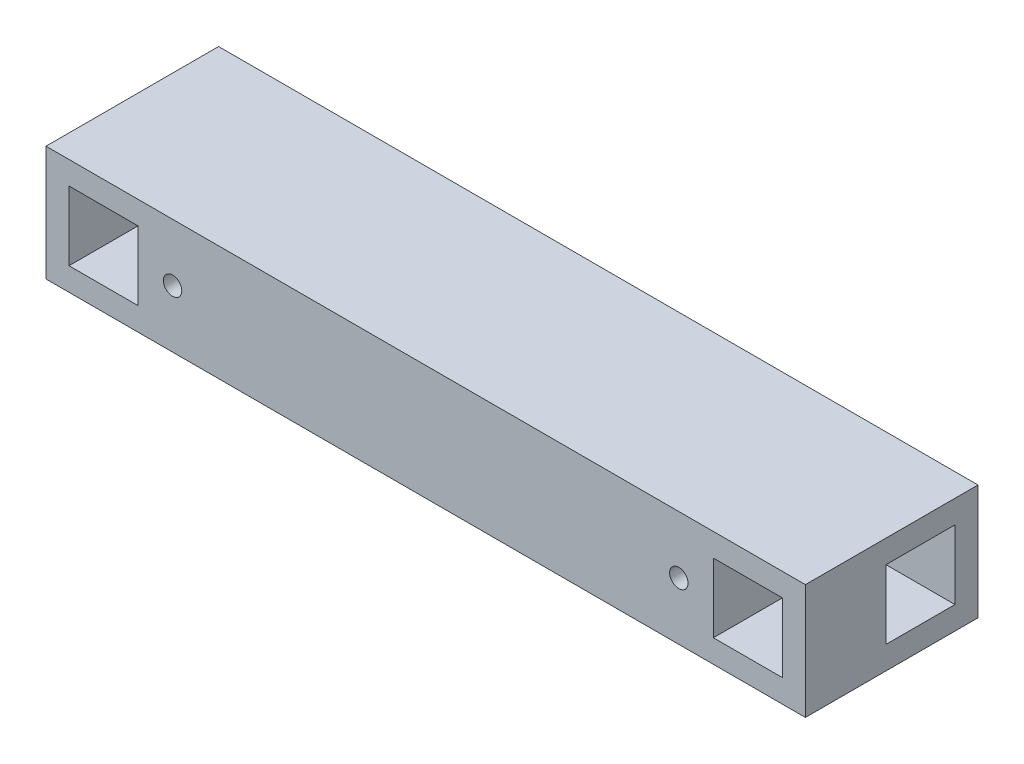
ISO-10303-21;
HEADER;
FILE_DESCRIPTION(('STEP AP214'),'2;1');
FILE_NAME('part.step','',(''),(''),'','','');
FILE_SCHEMA(('AUTOMOTIVE_DESIGN { 1 0 10303 214 1 1 1 1 }'));
ENDSEC;
DATA;
#1=APPLICATION_CONTEXT('core data for automotive mechanical design processes');
#2=APPLICATION_PROTOCOL_DEFINITION('international standard','automotive_design',2000,#1);
#3=PRODUCT_CONTEXT('',#1,'mechanical');
#4=PRODUCT('Part','Part','',(#3));
#5=PRODUCT_RELATED_PRODUCT_CATEGORY('part','',(#4));
#6=PRODUCT_DEFINITION_FORMATION('','',#4);
#7=PRODUCT_DEFINITION_CONTEXT('part definition',#1,'design');
#8=PRODUCT_DEFINITION('design','',#6,#7);
#9=PRODUCT_DEFINITION_SHAPE('','',#8);
#10=(LENGTH_UNIT() NAMED_UNIT(*) SI_UNIT(.MILLI.,.METRE.));
#11=(NAMED_UNIT(*) PLANE_ANGLE_UNIT() SI_UNIT($,.RADIAN.));
#12=(NAMED_UNIT(*) SI_UNIT($,.STERADIAN.) SOLID_ANGLE_UNIT());
#13=UNCERTAINTY_MEASURE_WITH_UNIT(LENGTH_MEASURE(1.E-05),#10,'distance_accuracy_value','');
#14=(GEOMETRIC_REPRESENTATION_CONTEXT(3) GLOBAL_UNCERTAINTY_ASSIGNED_CONTEXT((#13)) GLOBAL_UNIT_ASSIGNED_CONTEXT((#10,
#11,#12)) REPRESENTATION_CONTEXT('',''));
#15=CARTESIAN_POINT('',(0.,0.,0.));
#16=DIRECTION('',(0.,0.,1.));
#17=DIRECTION('',(1.,0.,0.));
#18=AXIS2_PLACEMENT_3D('',#15,#16,#17);
#19=CARTESIAN_POINT('',(165.,-25.,75.));
#20=DIRECTION('',(-1.,0.,0.));
#21=DIRECTION('',(0.,0.,1.));
#22=AXIS2_PLACEMENT_3D('',#19,#20,#21);
#23=PLANE('',#22);
#24=DIRECTION('',(0.,0.,-1.));
#25=VECTOR('',#24,1.);
#26=CARTESIAN_POINT('',(165.,15.,10.));
#27=LINE('',#26,#25);
#28=CARTESIAN_POINT('',(165.,15.,40.));
#29=VERTEX_POINT('',#28);
#30=CARTESIAN_POINT('',(165.,15.,10.));
#31=VERTEX_POINT('',#30);
#32=EDGE_CURVE('E154',#29,#31,#27,.T.);
#33=ORIENTED_EDGE('',*,*,#32,.T.);
#34=DIRECTION('',(0.,-1.,0.));
#35=VECTOR('',#34,1.);
#36=CARTESIAN_POINT('',(165.,15.,10.));
#37=LINE('',#36,#35);
#38=CARTESIAN_POINT('',(165.,-15.,10.));
#39=VERTEX_POINT('',#38);
#40=EDGE_CURVE('E148',#31,#39,#37,.T.);
#41=ORIENTED_EDGE('',*,*,#40,.T.);
#42=DIRECTION('',(0.,0.,1.));
#43=VECTOR('',#42,1.);
#44=CARTESIAN_POINT('',(165.,-15.,10.));
#45=LINE('',#44,#43);
#46=CARTESIAN_POINT('',(165.,-15.,40.));
#47=VERTEX_POINT('',#46);
#48=EDGE_CURVE('E157',#39,#47,#45,.T.);
#49=ORIENTED_EDGE('',*,*,#48,.T.);
#50=DIRECTION('',(0.,1.,0.));
#51=VECTOR('',#50,1.);
#52=CARTESIAN_POINT('',(165.,15.,40.));
#53=LINE('',#52,#51);
#54=EDGE_CURVE('E48',#47,#29,#53,.T.);
#55=ORIENTED_EDGE('',*,*,#54,.T.);
#56=EDGE_LOOP('',(#33,#41,#49,#55));
#57=FACE_BOUND('',#56,.T.);
#58=DIRECTION('',(0.,1.,0.));
#59=VECTOR('',#58,1.);
#60=CARTESIAN_POINT('',(165.,-25.,0.));
#61=LINE('',#60,#59);
#62=CARTESIAN_POINT('',(165.,-25.,0.));
#63=VERTEX_POINT('',#62);
#64=CARTESIAN_POINT('',(165.,25.,0.));
#65=VERTEX_POINT('',#64);
#66=EDGE_CURVE('E209',#63,#65,#61,.T.);
#67=ORIENTED_EDGE('',*,*,#66,.T.);
#68=DIRECTION('',(0.,0.,-1.));
#69=VECTOR('',#68,1.);
#70=CARTESIAN_POINT('',(165.,25.,75.));
#71=LINE('',#70,#69);
#72=CARTESIAN_POINT('',(165.,25.,75.));
#73=VERTEX_POINT('',#72);
#74=EDGE_CURVE('E11',#73,#65,#71,.T.);
#75=ORIENTED_EDGE('',*,*,#74,.F.);
#76=DIRECTION('',(0.,1.,0.));
#77=VECTOR('',#76,1.);
#78=CARTESIAN_POINT('',(165.,-25.,75.));
#79=LINE('',#78,#77);
#80=CARTESIAN_POINT('',(165.,-25.,75.));
#81=VERTEX_POINT('',#80);
#82=EDGE_CURVE('E258',#81,#73,#79,.T.);
#83=ORIENTED_EDGE('',*,*,#82,.F.);
#84=DIRECTION('',(0.,0.,-1.));
#85=VECTOR('',#84,1.);
#86=CARTESIAN_POINT('',(165.,-25.,75.));
#87=LINE('',#86,#85);
#88=EDGE_CURVE('E268',#81,#63,#87,.T.);
#89=ORIENTED_EDGE('',*,*,#88,.T.);
#90=EDGE_LOOP('',(#67,#75,#83,#89));
#91=FACE_BOUND('',#90,.T.);
#92=ADVANCED_FACE('F34',(#57,#91),#23,.F.);
#93=CARTESIAN_POINT('',(-165.,25.,75.));
#94=DIRECTION('',(0.,-1.,0.));
#95=DIRECTION('',(0.,0.,-1.));
#96=AXIS2_PLACEMENT_3D('',#93,#94,#95);
#97=PLANE('',#96);
#98=DIRECTION('',(-1.,0.,0.));
#99=VECTOR('',#98,1.);
#100=CARTESIAN_POINT('',(-165.,25.,0.));
#101=LINE('',#100,#99);
#102=CARTESIAN_POINT('',(-165.,25.,0.));
#103=VERTEX_POINT('',#102);
#104=EDGE_CURVE('E271',#65,#103,#101,.T.);
#105=ORIENTED_EDGE('',*,*,#104,.T.);
#106=DIRECTION('',(0.,0.,-1.));
#107=VECTOR('',#106,1.);
#108=CARTESIAN_POINT('',(-165.,25.,75.));
#109=LINE('',#108,#107);
#110=CARTESIAN_POINT('',(-165.,25.,75.));
#111=VERTEX_POINT('',#110);
#112=EDGE_CURVE('E41',#111,#103,#109,.T.);
#113=ORIENTED_EDGE('',*,*,#112,.F.);
#114=DIRECTION('',(-1.,0.,0.));
#115=VECTOR('',#114,1.);
#116=CARTESIAN_POINT('',(-165.,25.,75.));
#117=LINE('',#116,#115);
#118=EDGE_CURVE('E261',#73,#111,#117,.T.);
#119=ORIENTED_EDGE('',*,*,#118,.F.);
#120=ORIENTED_EDGE('',*,*,#74,.T.);
#121=EDGE_LOOP('',(#105,#113,#119,#120));
#122=FACE_BOUND('',#121,.T.);
#123=ADVANCED_FACE('F300',(#122),#97,.F.);
#124=CARTESIAN_POINT('',(-165.,-25.,75.));
#125=DIRECTION('',(1.,0.,0.));
#126=DIRECTION('',(0.,0.,-1.));
#127=AXIS2_PLACEMENT_3D('',#124,#125,#126);
#128=PLANE('',#127);
#129=DIRECTION('',(0.,0.,1.));
#130=VECTOR('',#129,1.);
#131=CARTESIAN_POINT('',(-165.,-15.,10.));
#132=LINE('',#131,#130);
#133=CARTESIAN_POINT('',(-165.,-15.,10.));
#134=VERTEX_POINT('',#133);
#135=CARTESIAN_POINT('',(-165.,-15.,40.));
#136=VERTEX_POINT('',#135);
#137=EDGE_CURVE('E172',#134,#136,#132,.T.);
#138=ORIENTED_EDGE('',*,*,#137,.F.);
#139=DIRECTION('',(0.,-1.,0.));
#140=VECTOR('',#139,1.);
#141=CARTESIAN_POINT('',(-165.,15.,10.));
#142=LINE('',#141,#140);
#143=CARTESIAN_POINT('',(-165.,15.,10.));
#144=VERTEX_POINT('',#143);
#145=EDGE_CURVE('E56',#144,#134,#142,.T.);
#146=ORIENTED_EDGE('',*,*,#145,.F.);
#147=DIRECTION('',(0.,0.,-1.));
#148=VECTOR('',#147,1.);
#149=CARTESIAN_POINT('',(-165.,15.,10.));
#150=LINE('',#149,#148);
#151=CARTESIAN_POINT('',(-165.,15.,40.));
#152=VERTEX_POINT('',#151);
#153=EDGE_CURVE('E163',#152,#144,#150,.T.);
#154=ORIENTED_EDGE('',*,*,#153,.F.);
#155=DIRECTION('',(0.,1.,0.));
#156=VECTOR('',#155,1.);
#157=CARTESIAN_POINT('',(-165.,15.,40.));
#158=LINE('',#157,#156);
#159=EDGE_CURVE('E166',#136,#152,#158,.T.);
#160=ORIENTED_EDGE('',*,*,#159,.F.);
#161=EDGE_LOOP('',(#138,#146,#154,#160));
#162=FACE_BOUND('',#161,.T.);
#163=DIRECTION('',(0.,-1.,0.));
#164=VECTOR('',#163,1.);
#165=CARTESIAN_POINT('',(-165.,-25.,0.));
#166=LINE('',#165,#164);
#167=CARTESIAN_POINT('',(-165.,-25.,0.));
#168=VERTEX_POINT('',#167);
#169=EDGE_CURVE('E273',#103,#168,#166,.T.);
#170=ORIENTED_EDGE('',*,*,#169,.T.);
#171=DIRECTION('',(0.,0.,-1.));
#172=VECTOR('',#171,1.);
#173=CARTESIAN_POINT('',(-165.,-25.,75.));
#174=LINE('',#173,#172);
#175=CARTESIAN_POINT('',(-165.,-25.,75.));
#176=VERTEX_POINT('',#175);
#177=EDGE_CURVE('E278',#176,#168,#174,.T.);
#178=ORIENTED_EDGE('',*,*,#177,.F.);
#179=DIRECTION('',(0.,-1.,0.));
#180=VECTOR('',#179,1.);
#181=CARTESIAN_POINT('',(-165.,-25.,75.));
#182=LINE('',#181,#180);
#183=EDGE_CURVE('E264',#111,#176,#182,.T.);
#184=ORIENTED_EDGE('',*,*,#183,.F.);
#185=ORIENTED_EDGE('',*,*,#112,.T.);
#186=EDGE_LOOP('',(#170,#178,#184,#185));
#187=FACE_BOUND('',#186,.T.);
#188=ADVANCED_FACE('F285',(#162,#187),#128,.F.);
#189=CARTESIAN_POINT('',(-165.,-25.,75.));
#190=DIRECTION('',(0.,1.,0.));
#191=DIRECTION('',(0.,0.,1.));
#192=AXIS2_PLACEMENT_3D('',#189,#190,#191);
#193=PLANE('',#192);
#194=DIRECTION('',(1.,0.,0.));
#195=VECTOR('',#194,1.);
#196=CARTESIAN_POINT('',(-165.,-25.,0.));
#197=LINE('',#196,#195);
#198=EDGE_CURVE('E262',#168,#63,#197,.T.);
#199=ORIENTED_EDGE('',*,*,#198,.T.);
#200=ORIENTED_EDGE('',*,*,#88,.F.);
#201=DIRECTION('',(1.,0.,0.));
#202=VECTOR('',#201,1.);
#203=CARTESIAN_POINT('',(-165.,-25.,75.));
#204=LINE('',#203,#202);
#205=EDGE_CURVE('E266',#176,#81,#204,.T.);
#206=ORIENTED_EDGE('',*,*,#205,.F.);
#207=ORIENTED_EDGE('',*,*,#177,.T.);
#208=EDGE_LOOP('',(#199,#200,#206,#207));
#209=FACE_BOUND('',#208,.T.);
#210=ADVANCED_FACE('F294',(#209),#193,.F.);
#211=CARTESIAN_POINT('',(0.,0.,75.));
#212=DIRECTION('',(0.,0.,-1.));
#213=DIRECTION('',(-1.,0.,0.));
#214=AXIS2_PLACEMENT_3D('',#211,#212,#213);
#215=PLANE('',#214);
#216=DIRECTION('',(1.,0.,0.));
#217=VECTOR('',#216,1.);
#218=CARTESIAN_POINT('',(-155.,-15.,75.));
#219=LINE('',#218,#217);
#220=CARTESIAN_POINT('',(-155.,-15.,75.));
#221=VERTEX_POINT('',#220);
#222=CARTESIAN_POINT('',(-125.,-15.,75.));
#223=VERTEX_POINT('',#222);
#224=EDGE_CURVE('E198',#221,#223,#219,.T.);
#225=ORIENTED_EDGE('',*,*,#224,.F.);
#226=DIRECTION('',(0.,-1.,0.));
#227=VECTOR('',#226,1.);
#228=CARTESIAN_POINT('',(-155.,15.,75.));
#229=LINE('',#228,#227);
#230=CARTESIAN_POINT('',(-155.,15.,75.));
#231=VERTEX_POINT('',#230);
#232=EDGE_CURVE('E196',#231,#221,#229,.T.);
#233=ORIENTED_EDGE('',*,*,#232,.F.);
#234=DIRECTION('',(-1.,0.,0.));
#235=VECTOR('',#234,1.);
#236=CARTESIAN_POINT('',(-155.,15.,75.));
#237=LINE('',#236,#235);
#238=CARTESIAN_POINT('',(-125.,15.,75.));
#239=VERTEX_POINT('',#238);
#240=EDGE_CURVE('E186',#239,#231,#237,.T.);
#241=ORIENTED_EDGE('',*,*,#240,.F.);
#242=DIRECTION('',(0.,1.,0.));
#243=VECTOR('',#242,1.);
#244=CARTESIAN_POINT('',(-125.,15.,75.));
#245=LINE('',#244,#243);
#246=EDGE_CURVE('E202',#223,#239,#245,.T.);
#247=ORIENTED_EDGE('',*,*,#246,.F.);
#248=EDGE_LOOP('',(#225,#233,#241,#247));
#249=FACE_BOUND('',#248,.T.);
#250=CARTESIAN_POINT('',(110.,0.,75.));
#251=DIRECTION('',(0.,0.,1.));
#252=DIRECTION('',(-1.,0.,0.));
#253=AXIS2_PLACEMENT_3D('',#250,#251,#252);
#254=CIRCLE('',#253,4.00000000000001);
#255=CARTESIAN_POINT('',(106.,0.,75.));
#256=VERTEX_POINT('',#255);
#257=EDGE_CURVE('E178',#256,#256,#254,.T.);
#258=ORIENTED_EDGE('',*,*,#257,.F.);
#259=EDGE_LOOP('',(#258));
#260=FACE_BOUND('',#259,.T.);
#261=CARTESIAN_POINT('',(-110.,0.,75.));
#262=DIRECTION('',(0.,0.,1.));
#263=DIRECTION('',(1.,0.,0.));
#264=AXIS2_PLACEMENT_3D('',#261,#262,#263);
#265=CIRCLE('',#264,4.00000000000001);
#266=CARTESIAN_POINT('',(-106.,0.,75.));
#267=VERTEX_POINT('',#266);
#268=EDGE_CURVE('E219',#267,#267,#265,.T.);
#269=ORIENTED_EDGE('',*,*,#268,.F.);
#270=EDGE_LOOP('',(#269));
#271=FACE_BOUND('',#270,.T.);
#272=DIRECTION('',(0.,-1.,0.));
#273=VECTOR('',#272,1.);
#274=CARTESIAN_POINT('',(125.,15.,75.));
#275=LINE('',#274,#273);
#276=CARTESIAN_POINT('',(125.,15.,75.));
#277=VERTEX_POINT('',#276);
#278=CARTESIAN_POINT('',(125.,-15.,75.));
#279=VERTEX_POINT('',#278);
#280=EDGE_CURVE('E238',#277,#279,#275,.T.);
#281=ORIENTED_EDGE('',*,*,#280,.F.);
#282=DIRECTION('',(-1.,0.,0.));
#283=VECTOR('',#282,1.);
#284=CARTESIAN_POINT('',(155.,15.,75.));
#285=LINE('',#284,#283);
#286=CARTESIAN_POINT('',(155.,15.,75.));
#287=VERTEX_POINT('',#286);
#288=EDGE_CURVE('E236',#287,#277,#285,.T.);
#289=ORIENTED_EDGE('',*,*,#288,.F.);
#290=DIRECTION('',(0.,1.,0.));
#291=VECTOR('',#290,1.);
#292=CARTESIAN_POINT('',(155.,15.,75.));
#293=LINE('',#292,#291);
#294=CARTESIAN_POINT('',(155.,-15.,75.));
#295=VERTEX_POINT('',#294);
#296=EDGE_CURVE('E226',#295,#287,#293,.T.);
#297=ORIENTED_EDGE('',*,*,#296,.F.);
#298=DIRECTION('',(1.,0.,0.));
#299=VECTOR('',#298,1.);
#300=CARTESIAN_POINT('',(155.,-15.,75.));
#301=LINE('',#300,#299);
#302=EDGE_CURVE('E242',#279,#295,#301,.T.);
#303=ORIENTED_EDGE('',*,*,#302,.F.);
#304=EDGE_LOOP('',(#281,#289,#297,#303));
#305=FACE_BOUND('',#304,.T.);
#306=ORIENTED_EDGE('',*,*,#82,.T.);
#307=ORIENTED_EDGE('',*,*,#118,.T.);
#308=ORIENTED_EDGE('',*,*,#183,.T.);
#309=ORIENTED_EDGE('',*,*,#205,.T.);
#310=EDGE_LOOP('',(#306,#307,#308,#309));
#311=FACE_BOUND('',#310,.T.);
#312=ADVANCED_FACE('F299',(#249,#260,#271,#305,#311),#215,.F.);
#313=CARTESIAN_POINT('',(0.,0.,0.));
#314=DIRECTION('',(0.,0.,-1.));
#315=DIRECTION('',(-1.,0.,0.));
#316=AXIS2_PLACEMENT_3D('',#313,#314,#315);
#317=PLANE('',#316);
#318=ORIENTED_EDGE('',*,*,#66,.F.);
#319=ORIENTED_EDGE('',*,*,#198,.F.);
#320=ORIENTED_EDGE('',*,*,#169,.F.);
#321=ORIENTED_EDGE('',*,*,#104,.F.);
#322=EDGE_LOOP('',(#318,#319,#320,#321));
#323=FACE_BOUND('',#322,.T.);
#324=ADVANCED_FACE('F291',(#323),#317,.T.);
#325=CARTESIAN_POINT('',(155.,15.,45.));
#326=DIRECTION('',(0.,1.,0.));
#327=DIRECTION('',(0.,0.,1.));
#328=AXIS2_PLACEMENT_3D('',#325,#326,#327);
#329=PLANE('',#328);
#330=ORIENTED_EDGE('',*,*,#288,.T.);
#331=DIRECTION('',(0.,0.,1.));
#332=VECTOR('',#331,1.);
#333=CARTESIAN_POINT('',(125.,15.,45.));
#334=LINE('',#333,#332);
#335=CARTESIAN_POINT('',(125.,15.,45.));
#336=VERTEX_POINT('',#335);
#337=EDGE_CURVE('E235',#336,#277,#334,.T.);
#338=ORIENTED_EDGE('',*,*,#337,.F.);
#339=DIRECTION('',(-1.,0.,0.));
#340=VECTOR('',#339,1.);
#341=CARTESIAN_POINT('',(155.,15.,45.));
#342=LINE('',#341,#340);
#343=CARTESIAN_POINT('',(155.,15.,45.));
#344=VERTEX_POINT('',#343);
#345=EDGE_CURVE('E222',#344,#336,#342,.T.);
#346=ORIENTED_EDGE('',*,*,#345,.F.);
#347=DIRECTION('',(0.,0.,1.));
#348=VECTOR('',#347,1.);
#349=CARTESIAN_POINT('',(155.,15.,45.));
#350=LINE('',#349,#348);
#351=EDGE_CURVE('E199',#344,#287,#350,.T.);
#352=ORIENTED_EDGE('',*,*,#351,.T.);
#353=EDGE_LOOP('',(#330,#338,#346,#352));
#354=FACE_BOUND('',#353,.T.);
#355=ADVANCED_FACE('F313',(#354),#329,.F.);
#356=CARTESIAN_POINT('',(155.,15.,45.));
#357=DIRECTION('',(1.,0.,0.));
#358=DIRECTION('',(0.,0.,-1.));
#359=AXIS2_PLACEMENT_3D('',#356,#357,#358);
#360=PLANE('',#359);
#361=ORIENTED_EDGE('',*,*,#296,.T.);
#362=ORIENTED_EDGE('',*,*,#351,.F.);
#363=DIRECTION('',(0.,1.,0.));
#364=VECTOR('',#363,1.);
#365=CARTESIAN_POINT('',(155.,15.,45.));
#366=LINE('',#365,#364);
#367=CARTESIAN_POINT('',(155.,-15.,45.));
#368=VERTEX_POINT('',#367);
#369=EDGE_CURVE('E232',#368,#344,#366,.T.);
#370=ORIENTED_EDGE('',*,*,#369,.F.);
#371=DIRECTION('',(0.,0.,1.));
#372=VECTOR('',#371,1.);
#373=CARTESIAN_POINT('',(155.,-15.,45.));
#374=LINE('',#373,#372);
#375=EDGE_CURVE('E248',#368,#295,#374,.T.);
#376=ORIENTED_EDGE('',*,*,#375,.T.);
#377=EDGE_LOOP('',(#361,#362,#370,#376));
#378=FACE_BOUND('',#377,.T.);
#379=ADVANCED_FACE('F329',(#378),#360,.F.);
#380=CARTESIAN_POINT('',(155.,-15.,45.));
#381=DIRECTION('',(0.,-1.,0.));
#382=DIRECTION('',(0.,0.,-1.));
#383=AXIS2_PLACEMENT_3D('',#380,#381,#382);
#384=PLANE('',#383);
#385=ORIENTED_EDGE('',*,*,#302,.T.);
#386=ORIENTED_EDGE('',*,*,#375,.F.);
#387=DIRECTION('',(1.,0.,0.));
#388=VECTOR('',#387,1.);
#389=CARTESIAN_POINT('',(155.,-15.,45.));
#390=LINE('',#389,#388);
#391=CARTESIAN_POINT('',(125.,-15.,45.));
#392=VERTEX_POINT('',#391);
#393=EDGE_CURVE('E229',#392,#368,#390,.T.);
#394=ORIENTED_EDGE('',*,*,#393,.F.);
#395=DIRECTION('',(0.,0.,1.));
#396=VECTOR('',#395,1.);
#397=CARTESIAN_POINT('',(125.,-15.,45.));
#398=LINE('',#397,#396);
#399=EDGE_CURVE('E250',#392,#279,#398,.T.);
#400=ORIENTED_EDGE('',*,*,#399,.T.);
#401=EDGE_LOOP('',(#385,#386,#394,#400));
#402=FACE_BOUND('',#401,.T.);
#403=ADVANCED_FACE('F334',(#402),#384,.F.);
#404=CARTESIAN_POINT('',(125.,15.,45.));
#405=DIRECTION('',(-1.,0.,0.));
#406=DIRECTION('',(0.,0.,1.));
#407=AXIS2_PLACEMENT_3D('',#404,#405,#406);
#408=PLANE('',#407);
#409=ORIENTED_EDGE('',*,*,#280,.T.);
#410=ORIENTED_EDGE('',*,*,#399,.F.);
#411=DIRECTION('',(0.,-1.,0.));
#412=VECTOR('',#411,1.);
#413=CARTESIAN_POINT('',(125.,15.,45.));
#414=LINE('',#413,#412);
#415=EDGE_CURVE('E225',#336,#392,#414,.T.);
#416=ORIENTED_EDGE('',*,*,#415,.F.);
#417=ORIENTED_EDGE('',*,*,#337,.T.);
#418=EDGE_LOOP('',(#409,#410,#416,#417));
#419=FACE_BOUND('',#418,.T.);
#420=ADVANCED_FACE('F331',(#419),#408,.F.);
#421=CARTESIAN_POINT('',(0.,0.,45.));
#422=DIRECTION('',(0.,0.,1.));
#423=DIRECTION('',(1.,0.,0.));
#424=AXIS2_PLACEMENT_3D('',#421,#422,#423);
#425=PLANE('',#424);
#426=ORIENTED_EDGE('',*,*,#345,.T.);
#427=ORIENTED_EDGE('',*,*,#415,.T.);
#428=ORIENTED_EDGE('',*,*,#393,.T.);
#429=ORIENTED_EDGE('',*,*,#369,.T.);
#430=EDGE_LOOP('',(#426,#427,#428,#429));
#431=FACE_BOUND('',#430,.T.);
#432=ADVANCED_FACE('F321',(#431),#425,.T.);
#433=CARTESIAN_POINT('',(-110.,0.,45.));
#434=DIRECTION('',(0.,0.,1.));
#435=DIRECTION('',(1.,0.,0.));
#436=AXIS2_PLACEMENT_3D('',#433,#434,#435);
#437=CYLINDRICAL_SURFACE('',#436,4.00000000000001);
#438=CARTESIAN_POINT('',(-110.,0.,45.));
#439=DIRECTION('',(0.,0.,1.));
#440=DIRECTION('',(1.,0.,0.));
#441=AXIS2_PLACEMENT_3D('',#438,#439,#440);
#442=CIRCLE('',#441,4.00000000000001);
#443=CARTESIAN_POINT('',(-106.,0.,45.));
#444=VERTEX_POINT('',#443);
#445=EDGE_CURVE('E239',#444,#444,#442,.T.);
#446=ORIENTED_EDGE('',*,*,#445,.F.);
#447=EDGE_LOOP('',(#446));
#448=FACE_BOUND('',#447,.T.);
#449=ORIENTED_EDGE('',*,*,#268,.T.);
#450=EDGE_LOOP('',(#449));
#451=FACE_BOUND('',#450,.T.);
#452=ADVANCED_FACE('F317',(#448,#451),#437,.F.);
#453=CARTESIAN_POINT('',(-110.,0.,45.));
#454=DIRECTION('',(0.,0.,1.));
#455=DIRECTION('',(1.,0.,0.));
#456=AXIS2_PLACEMENT_3D('',#453,#454,#455);
#457=PLANE('',#456);
#458=ORIENTED_EDGE('',*,*,#445,.T.);
#459=EDGE_LOOP('',(#458));
#460=FACE_BOUND('',#459,.T.);
#461=ADVANCED_FACE('F320',(#460),#457,.T.);
#462=CARTESIAN_POINT('',(110.,0.,45.));
#463=DIRECTION('',(0.,0.,1.));
#464=DIRECTION('',(1.,0.,0.));
#465=AXIS2_PLACEMENT_3D('',#462,#463,#464);
#466=CYLINDRICAL_SURFACE('',#465,4.00000000000001);
#467=CARTESIAN_POINT('',(110.,0.,45.));
#468=DIRECTION('',(0.,0.,1.));
#469=DIRECTION('',(-1.,0.,0.));
#470=AXIS2_PLACEMENT_3D('',#467,#468,#469);
#471=CIRCLE('',#470,4.00000000000001);
#472=CARTESIAN_POINT('',(106.,0.,45.));
#473=VERTEX_POINT('',#472);
#474=EDGE_CURVE('E216',#473,#473,#471,.T.);
#475=ORIENTED_EDGE('',*,*,#474,.F.);
#476=EDGE_LOOP('',(#475));
#477=FACE_BOUND('',#476,.T.);
#478=ORIENTED_EDGE('',*,*,#257,.T.);
#479=EDGE_LOOP('',(#478));
#480=FACE_BOUND('',#479,.T.);
#481=ADVANCED_FACE('F325',(#477,#480),#466,.F.);
#482=CARTESIAN_POINT('',(110.,0.,45.));
#483=DIRECTION('',(0.,0.,-1.));
#484=DIRECTION('',(-1.,0.,0.));
#485=AXIS2_PLACEMENT_3D('',#482,#483,#484);
#486=PLANE('',#485);
#487=ORIENTED_EDGE('',*,*,#474,.T.);
#488=EDGE_LOOP('',(#487));
#489=FACE_BOUND('',#488,.T.);
#490=ADVANCED_FACE('F347',(#489),#486,.F.);
#491=CARTESIAN_POINT('',(-155.,15.,45.));
#492=DIRECTION('',(-1.,0.,0.));
#493=DIRECTION('',(0.,0.,1.));
#494=AXIS2_PLACEMENT_3D('',#491,#492,#493);
#495=PLANE('',#494);
#496=ORIENTED_EDGE('',*,*,#232,.T.);
#497=DIRECTION('',(0.,0.,1.));
#498=VECTOR('',#497,1.);
#499=CARTESIAN_POINT('',(-155.,-15.,45.));
#500=LINE('',#499,#498);
#501=CARTESIAN_POINT('',(-155.,-15.,45.));
#502=VERTEX_POINT('',#501);
#503=EDGE_CURVE('E195',#502,#221,#500,.T.);
#504=ORIENTED_EDGE('',*,*,#503,.F.);
#505=DIRECTION('',(0.,-1.,0.));
#506=VECTOR('',#505,1.);
#507=CARTESIAN_POINT('',(-155.,15.,45.));
#508=LINE('',#507,#506);
#509=CARTESIAN_POINT('',(-155.,15.,45.));
#510=VERTEX_POINT('',#509);
#511=EDGE_CURVE('E182',#510,#502,#508,.T.);
#512=ORIENTED_EDGE('',*,*,#511,.F.);
#513=DIRECTION('',(0.,0.,1.));
#514=VECTOR('',#513,1.);
#515=CARTESIAN_POINT('',(-155.,15.,45.));
#516=LINE('',#515,#514);
#517=EDGE_CURVE('E207',#510,#231,#516,.T.);
#518=ORIENTED_EDGE('',*,*,#517,.T.);
#519=EDGE_LOOP('',(#496,#504,#512,#518));
#520=FACE_BOUND('',#519,.T.);
#521=ADVANCED_FACE('F351',(#520),#495,.F.);
#522=CARTESIAN_POINT('',(-155.,15.,45.));
#523=DIRECTION('',(0.,1.,0.));
#524=DIRECTION('',(0.,0.,1.));
#525=AXIS2_PLACEMENT_3D('',#522,#523,#524);
#526=PLANE('',#525);
#527=ORIENTED_EDGE('',*,*,#240,.T.);
#528=ORIENTED_EDGE('',*,*,#517,.F.);
#529=DIRECTION('',(-1.,0.,0.));
#530=VECTOR('',#529,1.);
#531=CARTESIAN_POINT('',(-155.,15.,45.));
#532=LINE('',#531,#530);
#533=CARTESIAN_POINT('',(-125.,15.,45.));
#534=VERTEX_POINT('',#533);
#535=EDGE_CURVE('E192',#534,#510,#532,.T.);
#536=ORIENTED_EDGE('',*,*,#535,.F.);
#537=DIRECTION('',(0.,0.,1.));
#538=VECTOR('',#537,1.);
#539=CARTESIAN_POINT('',(-125.,15.,45.));
#540=LINE('',#539,#538);
#541=EDGE_CURVE('E210',#534,#239,#540,.T.);
#542=ORIENTED_EDGE('',*,*,#541,.T.);
#543=EDGE_LOOP('',(#527,#528,#536,#542));
#544=FACE_BOUND('',#543,.T.);
#545=ADVANCED_FACE('F355',(#544),#526,.F.);
#546=CARTESIAN_POINT('',(-125.,15.,45.));
#547=DIRECTION('',(1.,0.,0.));
#548=DIRECTION('',(0.,0.,-1.));
#549=AXIS2_PLACEMENT_3D('',#546,#547,#548);
#550=PLANE('',#549);
#551=ORIENTED_EDGE('',*,*,#246,.T.);
#552=ORIENTED_EDGE('',*,*,#541,.F.);
#553=DIRECTION('',(0.,1.,0.));
#554=VECTOR('',#553,1.);
#555=CARTESIAN_POINT('',(-125.,15.,45.));
#556=LINE('',#555,#554);
#557=CARTESIAN_POINT('',(-125.,-15.,45.));
#558=VERTEX_POINT('',#557);
#559=EDGE_CURVE('E189',#558,#534,#556,.T.);
#560=ORIENTED_EDGE('',*,*,#559,.F.);
#561=DIRECTION('',(0.,0.,1.));
#562=VECTOR('',#561,1.);
#563=CARTESIAN_POINT('',(-125.,-15.,45.));
#564=LINE('',#563,#562);
#565=EDGE_CURVE('E212',#558,#223,#564,.T.);
#566=ORIENTED_EDGE('',*,*,#565,.T.);
#567=EDGE_LOOP('',(#551,#552,#560,#566));
#568=FACE_BOUND('',#567,.T.);
#569=ADVANCED_FACE('F361',(#568),#550,.F.);
#570=CARTESIAN_POINT('',(-155.,-15.,45.));
#571=DIRECTION('',(0.,-1.,0.));
#572=DIRECTION('',(0.,0.,-1.));
#573=AXIS2_PLACEMENT_3D('',#570,#571,#572);
#574=PLANE('',#573);
#575=ORIENTED_EDGE('',*,*,#224,.T.);
#576=ORIENTED_EDGE('',*,*,#565,.F.);
#577=DIRECTION('',(1.,0.,0.));
#578=VECTOR('',#577,1.);
#579=CARTESIAN_POINT('',(-155.,-15.,45.));
#580=LINE('',#579,#578);
#581=EDGE_CURVE('E185',#502,#558,#580,.T.);
#582=ORIENTED_EDGE('',*,*,#581,.F.);
#583=ORIENTED_EDGE('',*,*,#503,.T.);
#584=EDGE_LOOP('',(#575,#576,#582,#583));
#585=FACE_BOUND('',#584,.T.);
#586=ADVANCED_FACE('F357',(#585),#574,.F.);
#587=CARTESIAN_POINT('',(0.,0.,45.));
#588=DIRECTION('',(0.,0.,1.));
#589=DIRECTION('',(1.,0.,0.));
#590=AXIS2_PLACEMENT_3D('',#587,#588,#589);
#591=PLANE('',#590);
#592=ORIENTED_EDGE('',*,*,#511,.T.);
#593=ORIENTED_EDGE('',*,*,#581,.T.);
#594=ORIENTED_EDGE('',*,*,#559,.T.);
#595=ORIENTED_EDGE('',*,*,#535,.T.);
#596=EDGE_LOOP('',(#592,#593,#594,#595));
#597=FACE_BOUND('',#596,.T.);
#598=ADVANCED_FACE('F360',(#597),#591,.T.);
#599=CARTESIAN_POINT('',(165.,15.,10.));
#600=DIRECTION('',(0.,0.,-1.));
#601=DIRECTION('',(0.,1.,0.));
#602=AXIS2_PLACEMENT_3D('',#599,#600,#601);
#603=PLANE('',#602);
#604=ORIENTED_EDGE('',*,*,#145,.T.);
#605=DIRECTION('',(-1.,0.,0.));
#606=VECTOR('',#605,1.);
#607=CARTESIAN_POINT('',(165.,-15.,10.));
#608=LINE('',#607,#606);
#609=EDGE_CURVE('E144',#39,#134,#608,.T.);
#610=ORIENTED_EDGE('',*,*,#609,.F.);
#611=ORIENTED_EDGE('',*,*,#40,.F.);
#612=DIRECTION('',(-1.,0.,0.));
#613=VECTOR('',#612,1.);
#614=CARTESIAN_POINT('',(165.,15.,10.));
#615=LINE('',#614,#613);
#616=EDGE_CURVE('E176',#31,#144,#615,.T.);
#617=ORIENTED_EDGE('',*,*,#616,.T.);
#618=EDGE_LOOP('',(#604,#610,#611,#617));
#619=FACE_BOUND('',#618,.T.);
#620=ADVANCED_FACE('F146',(#619),#603,.F.);
#621=CARTESIAN_POINT('',(165.,15.,10.));
#622=DIRECTION('',(0.,1.,0.));
#623=DIRECTION('',(0.,0.,1.));
#624=AXIS2_PLACEMENT_3D('',#621,#622,#623);
#625=PLANE('',#624);
#626=ORIENTED_EDGE('',*,*,#153,.T.);
#627=ORIENTED_EDGE('',*,*,#616,.F.);
#628=ORIENTED_EDGE('',*,*,#32,.F.);
#629=DIRECTION('',(-1.,0.,0.));
#630=VECTOR('',#629,1.);
#631=CARTESIAN_POINT('',(165.,15.,40.));
#632=LINE('',#631,#630);
#633=EDGE_CURVE('E179',#29,#152,#632,.T.);
#634=ORIENTED_EDGE('',*,*,#633,.T.);
#635=EDGE_LOOP('',(#626,#627,#628,#634));
#636=FACE_BOUND('',#635,.T.);
#637=ADVANCED_FACE('F374',(#636),#625,.F.);
#638=CARTESIAN_POINT('',(165.,15.,40.));
#639=DIRECTION('',(0.,0.,1.));
#640=DIRECTION('',(1.,0.,0.));
#641=AXIS2_PLACEMENT_3D('',#638,#639,#640);
#642=PLANE('',#641);
#643=ORIENTED_EDGE('',*,*,#159,.T.);
#644=ORIENTED_EDGE('',*,*,#633,.F.);
#645=ORIENTED_EDGE('',*,*,#54,.F.);
#646=DIRECTION('',(-1.,0.,0.));
#647=VECTOR('',#646,1.);
#648=CARTESIAN_POINT('',(165.,-15.,40.));
#649=LINE('',#648,#647);
#650=EDGE_CURVE('E153',#47,#136,#649,.T.);
#651=ORIENTED_EDGE('',*,*,#650,.T.);
#652=EDGE_LOOP('',(#643,#644,#645,#651));
#653=FACE_BOUND('',#652,.T.);
#654=ADVANCED_FACE('F377',(#653),#642,.F.);
#655=CARTESIAN_POINT('',(165.,-15.,10.));
#656=DIRECTION('',(0.,-1.,0.));
#657=DIRECTION('',(0.,0.,-1.));
#658=AXIS2_PLACEMENT_3D('',#655,#656,#657);
#659=PLANE('',#658);
#660=ORIENTED_EDGE('',*,*,#137,.T.);
#661=ORIENTED_EDGE('',*,*,#650,.F.);
#662=ORIENTED_EDGE('',*,*,#48,.F.);
#663=ORIENTED_EDGE('',*,*,#609,.T.);
#664=EDGE_LOOP('',(#660,#661,#662,#663));
#665=FACE_BOUND('',#664,.T.);
#666=ADVANCED_FACE('F158',(#665),#659,.F.);
#667=CLOSED_SHELL('',(#92,#123,#188,#210,#312,#324,#355,#379,#403,#420,#432,#452,#461,#481,#490,
#521,#545,#569,#586,#598,#620,#637,#654,#666));
#668=MANIFOLD_SOLID_BREP('B2',#667);
#669=ADVANCED_BREP_SHAPE_REPRESENTATION('',(#18,#668),#14);
#670=SHAPE_DEFINITION_REPRESENTATION(#9,#669);
ENDSEC;
END-ISO-10303-21;
